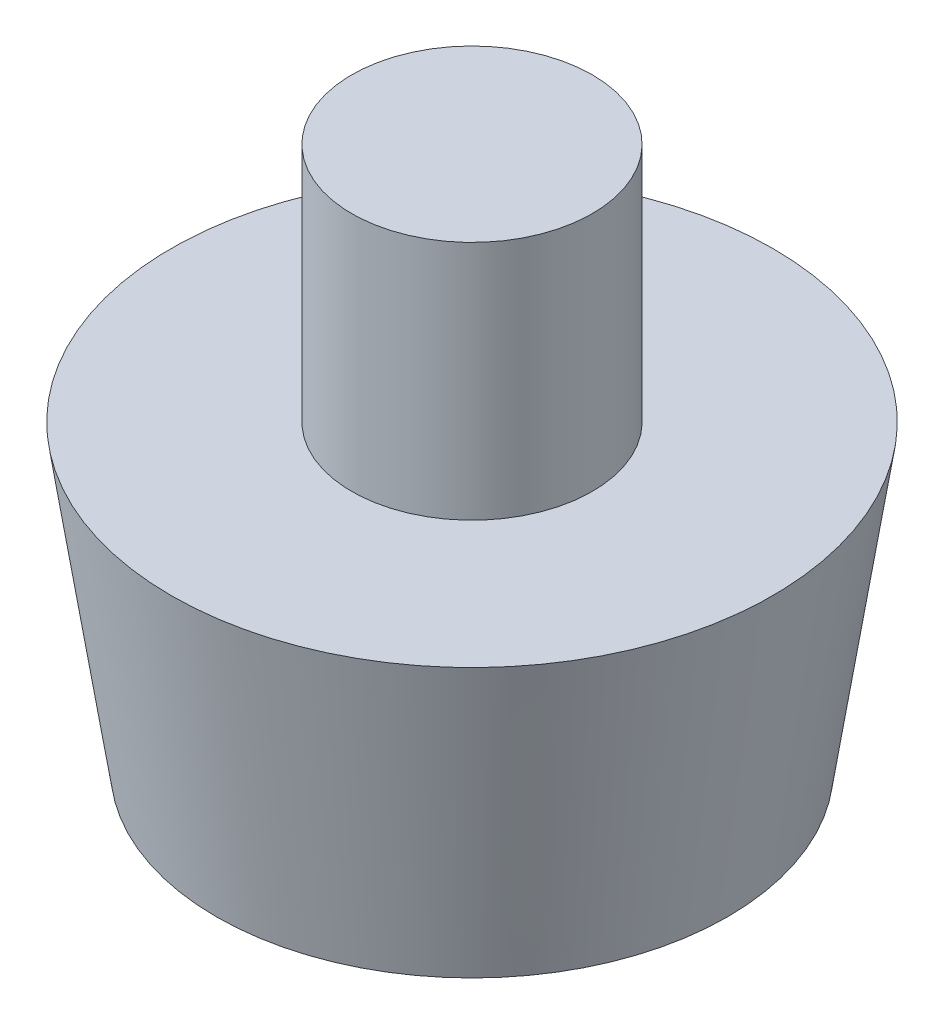
ISO-10303-21;
HEADER;
FILE_DESCRIPTION(('STEP AP214'),'2;1');
FILE_NAME('part.step','',(''),(''),'','','');
FILE_SCHEMA(('AUTOMOTIVE_DESIGN { 1 0 10303 214 1 1 1 1 }'));
ENDSEC;
DATA;
#1=APPLICATION_CONTEXT('core data for automotive mechanical design processes');
#2=APPLICATION_PROTOCOL_DEFINITION('international standard','automotive_design',2000,#1);
#3=PRODUCT_CONTEXT('',#1,'mechanical');
#4=PRODUCT('Part','Part','',(#3));
#5=PRODUCT_RELATED_PRODUCT_CATEGORY('part','',(#4));
#6=PRODUCT_DEFINITION_FORMATION('','',#4);
#7=PRODUCT_DEFINITION_CONTEXT('part definition',#1,'design');
#8=PRODUCT_DEFINITION('design','',#6,#7);
#9=PRODUCT_DEFINITION_SHAPE('','',#8);
#10=(LENGTH_UNIT() NAMED_UNIT(*) SI_UNIT(.MILLI.,.METRE.));
#11=(NAMED_UNIT(*) PLANE_ANGLE_UNIT() SI_UNIT($,.RADIAN.));
#12=(NAMED_UNIT(*) SI_UNIT($,.STERADIAN.) SOLID_ANGLE_UNIT());
#13=UNCERTAINTY_MEASURE_WITH_UNIT(LENGTH_MEASURE(1.E-05),#10,'distance_accuracy_value','');
#14=(GEOMETRIC_REPRESENTATION_CONTEXT(3) GLOBAL_UNCERTAINTY_ASSIGNED_CONTEXT((#13)) GLOBAL_UNIT_ASSIGNED_CONTEXT((#10,
#11,#12)) REPRESENTATION_CONTEXT('',''));
#15=CARTESIAN_POINT('',(0.,0.,0.));
#16=DIRECTION('',(0.,0.,1.));
#17=DIRECTION('',(1.,0.,0.));
#18=AXIS2_PLACEMENT_3D('',#15,#16,#17);
#19=CARTESIAN_POINT('',(0.,2.,0.));
#20=DIRECTION('',(0.,1.,0.));
#21=DIRECTION('',(0.,0.,1.));
#22=AXIS2_PLACEMENT_3D('',#19,#20,#21);
#23=PLANE('',#22);
#24=CARTESIAN_POINT('',(0.,2.,0.));
#25=DIRECTION('',(0.,-1.,0.));
#26=DIRECTION('',(0.,0.,-1.));
#27=AXIS2_PLACEMENT_3D('',#24,#25,#26);
#28=CIRCLE('',#27,3.);
#29=CARTESIAN_POINT('',(0.,2.,-3.));
#30=VERTEX_POINT('',#29);
#31=EDGE_CURVE('E10',#30,#30,#28,.T.);
#32=ORIENTED_EDGE('',*,*,#31,.T.);
#33=EDGE_LOOP('',(#32));
#34=FACE_BOUND('',#33,.T.);
#35=ADVANCED_FACE('F32',(#34),#23,.F.);
#36=CARTESIAN_POINT('',(0.,0.,0.));
#37=DIRECTION('',(0.,-1.,0.));
#38=DIRECTION('',(0.,0.,-1.));
#39=AXIS2_PLACEMENT_3D('',#36,#37,#38);
#40=CYLINDRICAL_SURFACE('',#39,3.);
#41=ORIENTED_EDGE('',*,*,#31,.F.);
#42=EDGE_LOOP('',(#41));
#43=FACE_BOUND('',#42,.T.);
#44=CARTESIAN_POINT('',(0.,4.5,0.));
#45=DIRECTION('',(0.,-1.,0.));
#46=DIRECTION('',(0.,0.,-1.));
#47=AXIS2_PLACEMENT_3D('',#44,#45,#46);
#48=CIRCLE('',#47,3.);
#49=CARTESIAN_POINT('',(0.,4.5,-3.));
#50=VERTEX_POINT('',#49);
#51=EDGE_CURVE('E38',#50,#50,#48,.T.);
#52=ORIENTED_EDGE('',*,*,#51,.T.);
#53=EDGE_LOOP('',(#52));
#54=FACE_BOUND('',#53,.T.);
#55=ADVANCED_FACE('F76',(#43,#54),#40,.T.);
#56=CARTESIAN_POINT('',(-3.,4.5,0.));
#57=DIRECTION('',(0.,1.,0.));
#58=DIRECTION('',(0.,0.,1.));
#59=AXIS2_PLACEMENT_3D('',#56,#57,#58);
#60=PLANE('',#59);
#61=ORIENTED_EDGE('',*,*,#51,.F.);
#62=EDGE_LOOP('',(#61));
#63=FACE_BOUND('',#62,.T.);
#64=CARTESIAN_POINT('',(0.,4.5,0.));
#65=DIRECTION('',(0.,-1.,0.));
#66=DIRECTION('',(0.,0.,-1.));
#67=AXIS2_PLACEMENT_3D('',#64,#65,#66);
#68=CIRCLE('',#67,4.);
#69=CARTESIAN_POINT('',(0.,4.5,-4.));
#70=VERTEX_POINT('',#69);
#71=EDGE_CURVE('E42',#70,#70,#68,.T.);
#72=ORIENTED_EDGE('',*,*,#71,.T.);
#73=EDGE_LOOP('',(#72));
#74=FACE_BOUND('',#73,.T.);
#75=ADVANCED_FACE('F80',(#63,#74),#60,.F.);
#76=CARTESIAN_POINT('',(0.,0.,0.));
#77=DIRECTION('',(0.,-1.,0.));
#78=DIRECTION('',(0.,0.,-1.));
#79=AXIS2_PLACEMENT_3D('',#76,#77,#78);
#80=CYLINDRICAL_SURFACE('',#79,4.);
#81=ORIENTED_EDGE('',*,*,#71,.F.);
#82=EDGE_LOOP('',(#81));
#83=FACE_BOUND('',#82,.T.);
#84=CARTESIAN_POINT('',(0.,0.,0.));
#85=DIRECTION('',(0.,-1.,0.));
#86=DIRECTION('',(0.,0.,-1.));
#87=AXIS2_PLACEMENT_3D('',#84,#85,#86);
#88=CIRCLE('',#87,4.);
#89=CARTESIAN_POINT('',(0.,0.,-4.));
#90=VERTEX_POINT('',#89);
#91=EDGE_CURVE('E46',#90,#90,#88,.T.);
#92=ORIENTED_EDGE('',*,*,#91,.T.);
#93=EDGE_LOOP('',(#92));
#94=FACE_BOUND('',#93,.T.);
#95=ADVANCED_FACE('F85',(#83,#94),#80,.F.);
#96=CARTESIAN_POINT('',(-4.,0.,0.));
#97=DIRECTION('',(0.,1.,0.));
#98=DIRECTION('',(0.,0.,1.));
#99=AXIS2_PLACEMENT_3D('',#96,#97,#98);
#100=PLANE('',#99);
#101=ORIENTED_EDGE('',*,*,#91,.F.);
#102=EDGE_LOOP('',(#101));
#103=FACE_BOUND('',#102,.T.);
#104=CARTESIAN_POINT('',(0.,0.,0.));
#105=DIRECTION('',(0.,-1.,0.));
#106=DIRECTION('',(0.,0.,-1.));
#107=AXIS2_PLACEMENT_3D('',#104,#105,#106);
#108=CIRCLE('',#107,8.5);
#109=CARTESIAN_POINT('',(0.,0.,-8.5));
#110=VERTEX_POINT('',#109);
#111=EDGE_CURVE('E51',#110,#110,#108,.T.);
#112=ORIENTED_EDGE('',*,*,#111,.T.);
#113=EDGE_LOOP('',(#112));
#114=FACE_BOUND('',#113,.T.);
#115=ADVANCED_FACE('F91',(#103,#114),#100,.F.);
#116=CARTESIAN_POINT('',(0.,10.,0.));
#117=DIRECTION('',(0.,1.,0.));
#118=DIRECTION('',(0.,0.,1.));
#119=AXIS2_PLACEMENT_3D('',#116,#117,#118);
#120=CONICAL_SURFACE('',#119,10.,0.148889947609497);
#121=ORIENTED_EDGE('',*,*,#111,.F.);
#122=EDGE_LOOP('',(#121));
#123=FACE_BOUND('',#122,.T.);
#124=CARTESIAN_POINT('',(0.,10.,0.));
#125=DIRECTION('',(0.,-1.,0.));
#126=DIRECTION('',(0.,0.,-1.));
#127=AXIS2_PLACEMENT_3D('',#124,#125,#126);
#128=CIRCLE('',#127,10.);
#129=CARTESIAN_POINT('',(0.,10.,-10.));
#130=VERTEX_POINT('',#129);
#131=EDGE_CURVE('E54',#130,#130,#128,.T.);
#132=ORIENTED_EDGE('',*,*,#131,.T.);
#133=EDGE_LOOP('',(#132));
#134=FACE_BOUND('',#133,.T.);
#135=ADVANCED_FACE('F95',(#123,#134),#120,.T.);
#136=CARTESIAN_POINT('',(-10.,10.,0.));
#137=DIRECTION('',(0.,-1.,0.));
#138=DIRECTION('',(0.,0.,-1.));
#139=AXIS2_PLACEMENT_3D('',#136,#137,#138);
#140=PLANE('',#139);
#141=ORIENTED_EDGE('',*,*,#131,.F.);
#142=EDGE_LOOP('',(#141));
#143=FACE_BOUND('',#142,.T.);
#144=CARTESIAN_POINT('',(0.,10.,0.));
#145=DIRECTION('',(0.,-1.,0.));
#146=DIRECTION('',(0.,0.,-1.));
#147=AXIS2_PLACEMENT_3D('',#144,#145,#146);
#148=CIRCLE('',#147,4.);
#149=CARTESIAN_POINT('',(0.,10.,-4.));
#150=VERTEX_POINT('',#149);
#151=EDGE_CURVE('E57',#150,#150,#148,.T.);
#152=ORIENTED_EDGE('',*,*,#151,.T.);
#153=EDGE_LOOP('',(#152));
#154=FACE_BOUND('',#153,.T.);
#155=ADVANCED_FACE('F72',(#143,#154),#140,.F.);
#156=CARTESIAN_POINT('',(0.,0.,0.));
#157=DIRECTION('',(0.,-1.,0.));
#158=DIRECTION('',(0.,0.,-1.));
#159=AXIS2_PLACEMENT_3D('',#156,#157,#158);
#160=CYLINDRICAL_SURFACE('',#159,4.);
#161=ORIENTED_EDGE('',*,*,#151,.F.);
#162=EDGE_LOOP('',(#161));
#163=FACE_BOUND('',#162,.T.);
#164=CARTESIAN_POINT('',(0.,18.,0.));
#165=DIRECTION('',(0.,-1.,0.));
#166=DIRECTION('',(0.,0.,-1.));
#167=AXIS2_PLACEMENT_3D('',#164,#165,#166);
#168=CIRCLE('',#167,4.);
#169=CARTESIAN_POINT('',(0.,18.,-4.));
#170=VERTEX_POINT('',#169);
#171=EDGE_CURVE('E60',#170,#170,#168,.T.);
#172=ORIENTED_EDGE('',*,*,#171,.T.);
#173=EDGE_LOOP('',(#172));
#174=FACE_BOUND('',#173,.T.);
#175=ADVANCED_FACE('F64',(#163,#174),#160,.T.);
#176=CARTESIAN_POINT('',(-4.,18.,0.));
#177=DIRECTION('',(0.,-1.,0.));
#178=DIRECTION('',(0.,0.,-1.));
#179=AXIS2_PLACEMENT_3D('',#176,#177,#178);
#180=PLANE('',#179);
#181=ORIENTED_EDGE('',*,*,#171,.F.);
#182=EDGE_LOOP('',(#181));
#183=FACE_BOUND('',#182,.T.);
#184=ADVANCED_FACE('F66',(#183),#180,.F.);
#185=CLOSED_SHELL('',(#35,#55,#75,#95,#115,#135,#155,#175,#184));
#186=MANIFOLD_SOLID_BREP('B2',#185);
#187=ADVANCED_BREP_SHAPE_REPRESENTATION('',(#18,#186),#14);
#188=SHAPE_DEFINITION_REPRESENTATION(#9,#187);
ENDSEC;
END-ISO-10303-21;
